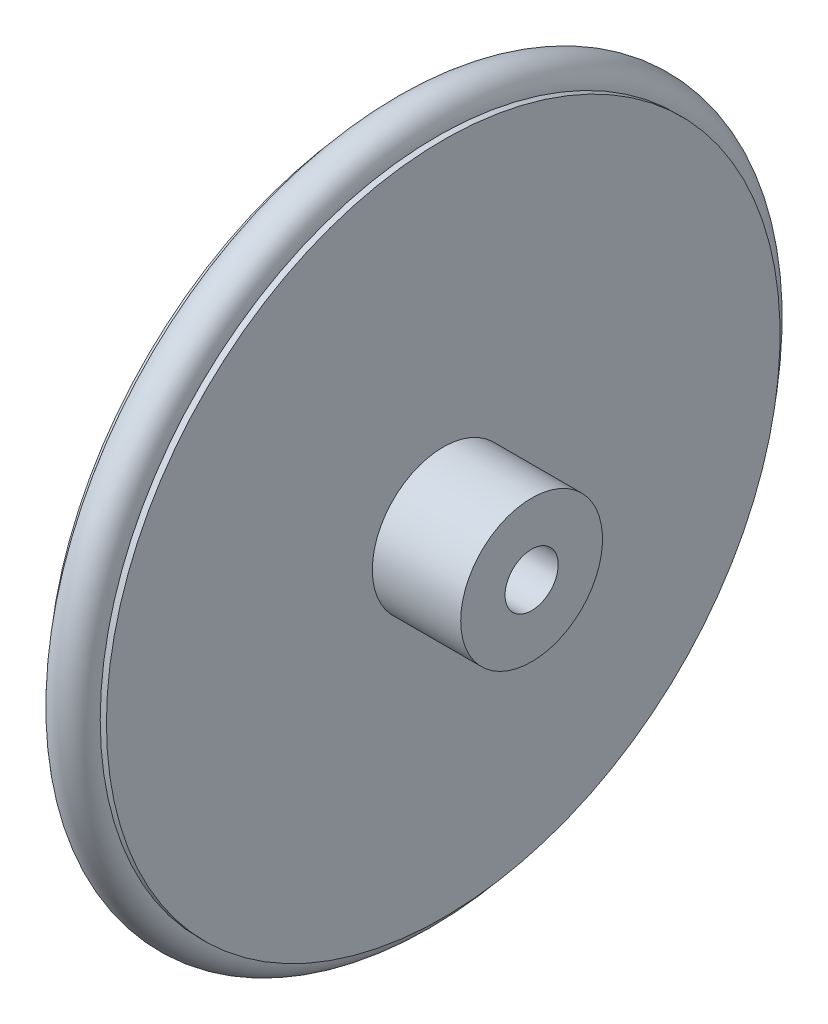
ISO-10303-21;
HEADER;
FILE_DESCRIPTION(('STEP AP214'),'2;1');
FILE_NAME('part.step','',(''),(''),'','','');
FILE_SCHEMA(('AUTOMOTIVE_DESIGN { 1 0 10303 214 1 1 1 1 }'));
ENDSEC;
DATA;
#1=APPLICATION_CONTEXT('core data for automotive mechanical design processes');
#2=APPLICATION_PROTOCOL_DEFINITION('international standard','automotive_design',2000,#1);
#3=PRODUCT_CONTEXT('',#1,'mechanical');
#4=PRODUCT('Part','Part','',(#3));
#5=PRODUCT_RELATED_PRODUCT_CATEGORY('part','',(#4));
#6=PRODUCT_DEFINITION_FORMATION('','',#4);
#7=PRODUCT_DEFINITION_CONTEXT('part definition',#1,'design');
#8=PRODUCT_DEFINITION('design','',#6,#7);
#9=PRODUCT_DEFINITION_SHAPE('','',#8);
#10=(LENGTH_UNIT() NAMED_UNIT(*) SI_UNIT(.MILLI.,.METRE.));
#11=(NAMED_UNIT(*) PLANE_ANGLE_UNIT() SI_UNIT($,.RADIAN.));
#12=(NAMED_UNIT(*) SI_UNIT($,.STERADIAN.) SOLID_ANGLE_UNIT());
#13=UNCERTAINTY_MEASURE_WITH_UNIT(LENGTH_MEASURE(1.E-05),#10,'distance_accuracy_value','');
#14=(GEOMETRIC_REPRESENTATION_CONTEXT(3) GLOBAL_UNCERTAINTY_ASSIGNED_CONTEXT((#13)) GLOBAL_UNIT_ASSIGNED_CONTEXT((#10,
#11,#12)) REPRESENTATION_CONTEXT('',''));
#15=CARTESIAN_POINT('',(0.,0.,0.));
#16=DIRECTION('',(0.,0.,1.));
#17=DIRECTION('',(1.,0.,0.));
#18=AXIS2_PLACEMENT_3D('',#15,#16,#17);
#19=CARTESIAN_POINT('',(3.30000000000003,0.,0.));
#20=DIRECTION('',(-1.,0.,0.));
#21=DIRECTION('',(0.,0.,1.));
#22=AXIS2_PLACEMENT_3D('',#19,#20,#21);
#23=TOROIDAL_SURFACE('',#22,38.,2.5);
#24=CARTESIAN_POINT('',(3.30000000000003,38.,0.));
#25=DIRECTION('',(0.,0.,1.));
#26=DIRECTION('',(1.,0.,0.));
#27=AXIS2_PLACEMENT_3D('',#24,#25,#26);
#28=CIRCLE('',#27,2.5);
#29=CARTESIAN_POINT('',(3.30000000000003,40.5,0.));
#30=VERTEX_POINT('',#29);
#31=EDGE_CURVE('E11',#30,#30,#28,.T.);
#32=CARTESIAN_POINT('',(3.30000000000003,0.,0.));
#33=DIRECTION('',(-1.,0.,0.));
#34=DIRECTION('',(0.,0.,1.));
#35=AXIS2_PLACEMENT_3D('',#32,#33,#34);
#36=CIRCLE('',#35,40.5);
#37=EDGE_CURVE('',#30,#30,#36,.T.);
#38=ORIENTED_EDGE('',*,*,#31,.F.);
#39=ORIENTED_EDGE('',*,*,#31,.T.);
#40=ORIENTED_EDGE('',*,*,#37,.T.);
#41=ORIENTED_EDGE('',*,*,#37,.F.);
#42=EDGE_LOOP('',(#38,#40,#39,#41));
#43=FACE_BOUND('',#42,.T.);
#44=ADVANCED_FACE('F47',(#43),#23,.T.);
#45=CLOSED_SHELL('',(#44));
#46=MANIFOLD_SOLID_BREP('B2',#45);
#47=CARTESIAN_POINT('',(0.,38.,0.));
#48=DIRECTION('',(1.,0.,0.));
#49=DIRECTION('',(0.,0.,-1.));
#50=AXIS2_PLACEMENT_3D('',#47,#48,#49);
#51=PLANE('',#50);
#52=CARTESIAN_POINT('',(0.,0.,0.));
#53=DIRECTION('',(1.,0.,0.));
#54=DIRECTION('',(0.,0.,-1.));
#55=AXIS2_PLACEMENT_3D('',#52,#53,#54);
#56=CIRCLE('',#55,3.);
#57=CARTESIAN_POINT('',(0.,0.,-3.));
#58=VERTEX_POINT('',#57);
#59=EDGE_CURVE('E111',#58,#58,#56,.T.);
#60=ORIENTED_EDGE('',*,*,#59,.T.);
#61=EDGE_LOOP('',(#60));
#62=FACE_BOUND('',#61,.T.);
#63=CARTESIAN_POINT('',(0.,0.,0.));
#64=DIRECTION('',(-1.,0.,0.));
#65=DIRECTION('',(0.,0.,1.));
#66=AXIS2_PLACEMENT_3D('',#63,#64,#65);
#67=CIRCLE('',#66,38.);
#68=CARTESIAN_POINT('',(0.,0.,38.));
#69=VERTEX_POINT('',#68);
#70=EDGE_CURVE('E108',#69,#69,#67,.T.);
#71=ORIENTED_EDGE('',*,*,#70,.T.);
#72=EDGE_LOOP('',(#71));
#73=FACE_BOUND('',#72,.T.);
#74=ADVANCED_FACE('F80',(#62,#73),#51,.F.);
#75=CARTESIAN_POINT('',(16.57,0.,0.));
#76=DIRECTION('',(-1.,0.,0.));
#77=DIRECTION('',(0.,0.,1.));
#78=AXIS2_PLACEMENT_3D('',#75,#76,#77);
#79=PLANE('',#78);
#80=CARTESIAN_POINT('',(16.57,0.,0.));
#81=DIRECTION('',(1.,0.,0.));
#82=DIRECTION('',(0.,0.,-1.));
#83=AXIS2_PLACEMENT_3D('',#80,#81,#82);
#84=CIRCLE('',#83,3.);
#85=CARTESIAN_POINT('',(16.57,0.,-3.));
#86=VERTEX_POINT('',#85);
#87=EDGE_CURVE('E112',#86,#86,#84,.T.);
#88=ORIENTED_EDGE('',*,*,#87,.F.);
#89=EDGE_LOOP('',(#88));
#90=FACE_BOUND('',#89,.T.);
#91=CARTESIAN_POINT('',(16.57,0.,0.));
#92=DIRECTION('',(-1.,0.,0.));
#93=DIRECTION('',(0.,0.,1.));
#94=AXIS2_PLACEMENT_3D('',#91,#92,#93);
#95=CIRCLE('',#94,8.);
#96=CARTESIAN_POINT('',(16.57,0.,8.));
#97=VERTEX_POINT('',#96);
#98=EDGE_CURVE('E46',#97,#97,#95,.T.);
#99=ORIENTED_EDGE('',*,*,#98,.F.);
#100=EDGE_LOOP('',(#99));
#101=FACE_BOUND('',#100,.T.);
#102=ADVANCED_FACE('F127',(#90,#101),#79,.F.);
#103=CARTESIAN_POINT('',(-19.9450853035614,0.,0.));
#104=DIRECTION('',(-1.,0.,0.));
#105=DIRECTION('',(0.,0.,1.));
#106=AXIS2_PLACEMENT_3D('',#103,#104,#105);
#107=CYLINDRICAL_SURFACE('',#106,8.);
#108=CARTESIAN_POINT('',(6.6,0.,0.));
#109=DIRECTION('',(-1.,0.,0.));
#110=DIRECTION('',(0.,0.,1.));
#111=AXIS2_PLACEMENT_3D('',#108,#109,#110);
#112=CIRCLE('',#111,8.);
#113=CARTESIAN_POINT('',(6.6,0.,8.));
#114=VERTEX_POINT('',#113);
#115=EDGE_CURVE('E86',#114,#114,#112,.T.);
#116=ORIENTED_EDGE('',*,*,#115,.F.);
#117=EDGE_LOOP('',(#116));
#118=FACE_BOUND('',#117,.T.);
#119=ORIENTED_EDGE('',*,*,#98,.T.);
#120=EDGE_LOOP('',(#119));
#121=FACE_BOUND('',#120,.T.);
#122=ADVANCED_FACE('F130',(#118,#121),#107,.T.);
#123=CARTESIAN_POINT('',(6.6,8.,0.));
#124=DIRECTION('',(-1.,0.,0.));
#125=DIRECTION('',(0.,0.,1.));
#126=AXIS2_PLACEMENT_3D('',#123,#124,#125);
#127=PLANE('',#126);
#128=CARTESIAN_POINT('',(6.6,0.,0.));
#129=DIRECTION('',(-1.,0.,0.));
#130=DIRECTION('',(0.,0.,1.));
#131=AXIS2_PLACEMENT_3D('',#128,#129,#130);
#132=CIRCLE('',#131,38.);
#133=CARTESIAN_POINT('',(6.6,0.,38.));
#134=VERTEX_POINT('',#133);
#135=EDGE_CURVE('E90',#134,#134,#132,.T.);
#136=ORIENTED_EDGE('',*,*,#135,.F.);
#137=EDGE_LOOP('',(#136));
#138=FACE_BOUND('',#137,.T.);
#139=ORIENTED_EDGE('',*,*,#115,.T.);
#140=EDGE_LOOP('',(#139));
#141=FACE_BOUND('',#140,.T.);
#142=ADVANCED_FACE('F135',(#138,#141),#127,.F.);
#143=CARTESIAN_POINT('',(-19.9450853035614,0.,0.));
#144=DIRECTION('',(-1.,0.,0.));
#145=DIRECTION('',(0.,0.,1.));
#146=AXIS2_PLACEMENT_3D('',#143,#144,#145);
#147=CYLINDRICAL_SURFACE('',#146,38.);
#148=CARTESIAN_POINT('',(5.9,0.,0.));
#149=DIRECTION('',(-1.,0.,0.));
#150=DIRECTION('',(0.,0.,1.));
#151=AXIS2_PLACEMENT_3D('',#148,#149,#150);
#152=CIRCLE('',#151,38.);
#153=CARTESIAN_POINT('',(5.9,0.,38.));
#154=VERTEX_POINT('',#153);
#155=EDGE_CURVE('E94',#154,#154,#152,.T.);
#156=ORIENTED_EDGE('',*,*,#155,.F.);
#157=EDGE_LOOP('',(#156));
#158=FACE_BOUND('',#157,.T.);
#159=ORIENTED_EDGE('',*,*,#135,.T.);
#160=EDGE_LOOP('',(#159));
#161=FACE_BOUND('',#160,.T.);
#162=ADVANCED_FACE('F141',(#158,#161),#147,.T.);
#163=CARTESIAN_POINT('',(5.90000000000003,38.,0.));
#164=DIRECTION('',(1.,0.,0.));
#165=DIRECTION('',(0.,0.,-1.));
#166=AXIS2_PLACEMENT_3D('',#163,#164,#165);
#167=PLANE('',#166);
#168=CARTESIAN_POINT('',(5.90000000000004,0.,0.));
#169=DIRECTION('',(-1.,0.,0.));
#170=DIRECTION('',(0.,0.,1.));
#171=AXIS2_PLACEMENT_3D('',#168,#169,#170);
#172=CIRCLE('',#171,35.);
#173=CARTESIAN_POINT('',(5.90000000000004,0.,35.));
#174=VERTEX_POINT('',#173);
#175=EDGE_CURVE('E99',#174,#174,#172,.T.);
#176=ORIENTED_EDGE('',*,*,#175,.F.);
#177=EDGE_LOOP('',(#176));
#178=FACE_BOUND('',#177,.T.);
#179=ORIENTED_EDGE('',*,*,#155,.T.);
#180=EDGE_LOOP('',(#179));
#181=FACE_BOUND('',#180,.T.);
#182=ADVANCED_FACE('F145',(#178,#181),#167,.F.);
#183=CARTESIAN_POINT('',(-19.9450853035614,0.,0.));
#184=DIRECTION('',(-1.,0.,0.));
#185=DIRECTION('',(0.,0.,1.));
#186=AXIS2_PLACEMENT_3D('',#183,#184,#185);
#187=CYLINDRICAL_SURFACE('',#186,35.);
#188=CARTESIAN_POINT('',(0.700000000000041,0.,0.));
#189=DIRECTION('',(-1.,0.,0.));
#190=DIRECTION('',(0.,0.,1.));
#191=AXIS2_PLACEMENT_3D('',#188,#189,#190);
#192=CIRCLE('',#191,35.);
#193=CARTESIAN_POINT('',(0.700000000000041,0.,35.));
#194=VERTEX_POINT('',#193);
#195=EDGE_CURVE('E102',#194,#194,#192,.T.);
#196=ORIENTED_EDGE('',*,*,#195,.F.);
#197=EDGE_LOOP('',(#196));
#198=FACE_BOUND('',#197,.T.);
#199=ORIENTED_EDGE('',*,*,#175,.T.);
#200=EDGE_LOOP('',(#199));
#201=FACE_BOUND('',#200,.T.);
#202=ADVANCED_FACE('F149',(#198,#201),#187,.T.);
#203=CARTESIAN_POINT('',(0.700000000000042,35.,0.));
#204=DIRECTION('',(-1.,0.,0.));
#205=DIRECTION('',(0.,0.,1.));
#206=AXIS2_PLACEMENT_3D('',#203,#204,#205);
#207=PLANE('',#206);
#208=CARTESIAN_POINT('',(0.700000000000041,0.,0.));
#209=DIRECTION('',(-1.,0.,0.));
#210=DIRECTION('',(0.,0.,1.));
#211=AXIS2_PLACEMENT_3D('',#208,#209,#210);
#212=CIRCLE('',#211,38.);
#213=CARTESIAN_POINT('',(0.700000000000041,0.,38.));
#214=VERTEX_POINT('',#213);
#215=EDGE_CURVE('E105',#214,#214,#212,.T.);
#216=ORIENTED_EDGE('',*,*,#215,.F.);
#217=EDGE_LOOP('',(#216));
#218=FACE_BOUND('',#217,.T.);
#219=ORIENTED_EDGE('',*,*,#195,.T.);
#220=EDGE_LOOP('',(#219));
#221=FACE_BOUND('',#220,.T.);
#222=ADVANCED_FACE('F153',(#218,#221),#207,.F.);
#223=CARTESIAN_POINT('',(-19.9450853035614,0.,0.));
#224=DIRECTION('',(-1.,0.,0.));
#225=DIRECTION('',(0.,0.,1.));
#226=AXIS2_PLACEMENT_3D('',#223,#224,#225);
#227=CYLINDRICAL_SURFACE('',#226,38.);
#228=ORIENTED_EDGE('',*,*,#70,.F.);
#229=EDGE_LOOP('',(#228));
#230=FACE_BOUND('',#229,.T.);
#231=ORIENTED_EDGE('',*,*,#215,.T.);
#232=EDGE_LOOP('',(#231));
#233=FACE_BOUND('',#232,.T.);
#234=ADVANCED_FACE('F123',(#230,#233),#227,.T.);
#235=CARTESIAN_POINT('',(0.,0.,0.));
#236=DIRECTION('',(1.,0.,0.));
#237=DIRECTION('',(0.,0.,-1.));
#238=AXIS2_PLACEMENT_3D('',#235,#236,#237);
#239=CYLINDRICAL_SURFACE('',#238,3.);
#240=ORIENTED_EDGE('',*,*,#59,.F.);
#241=EDGE_LOOP('',(#240));
#242=FACE_BOUND('',#241,.T.);
#243=ORIENTED_EDGE('',*,*,#87,.T.);
#244=EDGE_LOOP('',(#243));
#245=FACE_BOUND('',#244,.T.);
#246=ADVANCED_FACE('F120',(#242,#245),#239,.F.);
#247=CLOSED_SHELL('',(#74,#102,#122,#142,#162,#182,#202,#222,#234,#246));
#248=MANIFOLD_SOLID_BREP('B6',#247);
#249=ADVANCED_BREP_SHAPE_REPRESENTATION('',(#18,#46,#248),#14);
#250=SHAPE_DEFINITION_REPRESENTATION(#9,#249);
ENDSEC;
END-ISO-10303-21;
